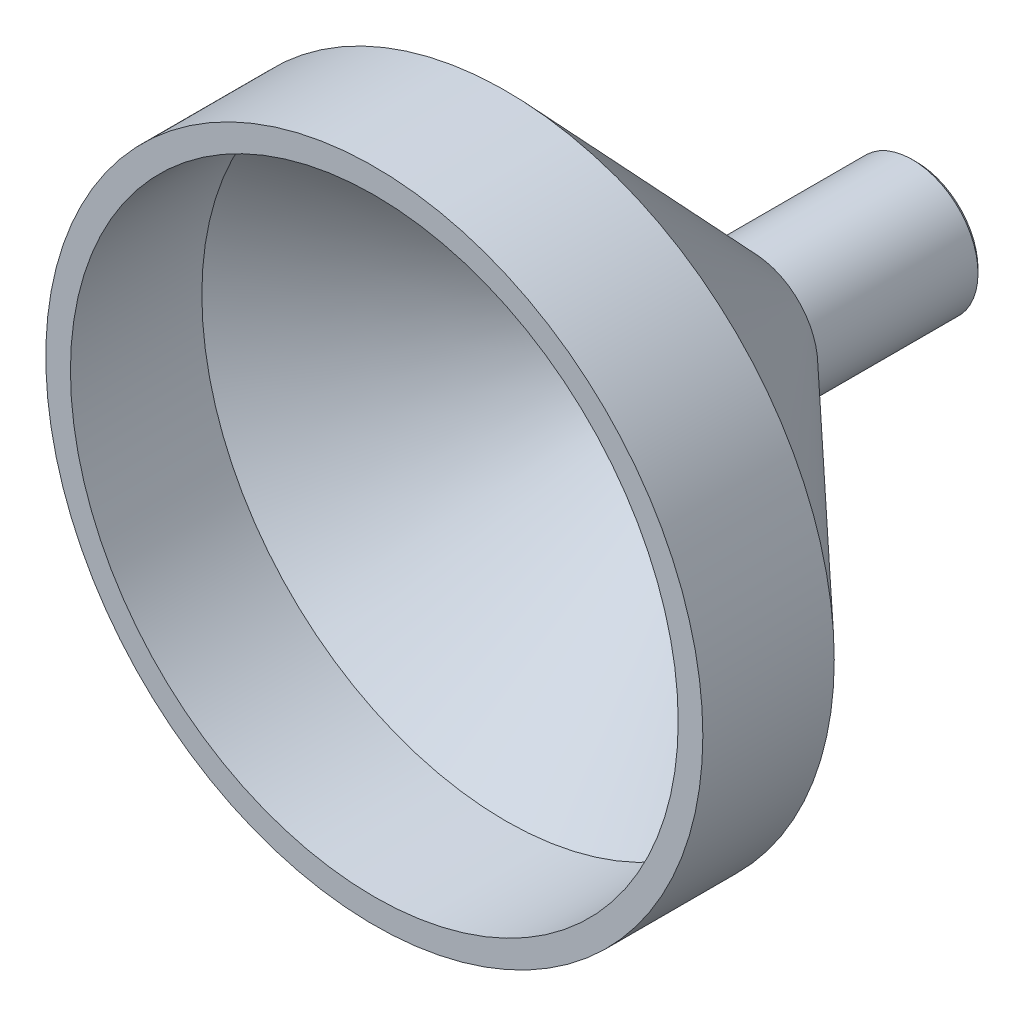
ISO-10303-21;
HEADER;
FILE_DESCRIPTION(('STEP AP214'),'2;1');
FILE_NAME('part.step','',(''),(''),'','','');
FILE_SCHEMA(('AUTOMOTIVE_DESIGN { 1 0 10303 214 1 1 1 1 }'));
ENDSEC;
DATA;
#1=APPLICATION_CONTEXT('core data for automotive mechanical design processes');
#2=APPLICATION_PROTOCOL_DEFINITION('international standard','automotive_design',2000,#1);
#3=PRODUCT_CONTEXT('',#1,'mechanical');
#4=PRODUCT('Part','Part','',(#3));
#5=PRODUCT_RELATED_PRODUCT_CATEGORY('part','',(#4));
#6=PRODUCT_DEFINITION_FORMATION('','',#4);
#7=PRODUCT_DEFINITION_CONTEXT('part definition',#1,'design');
#8=PRODUCT_DEFINITION('design','',#6,#7);
#9=PRODUCT_DEFINITION_SHAPE('','',#8);
#10=(LENGTH_UNIT() NAMED_UNIT(*) SI_UNIT(.MILLI.,.METRE.));
#11=(NAMED_UNIT(*) PLANE_ANGLE_UNIT() SI_UNIT($,.RADIAN.));
#12=(NAMED_UNIT(*) SI_UNIT($,.STERADIAN.) SOLID_ANGLE_UNIT());
#13=UNCERTAINTY_MEASURE_WITH_UNIT(LENGTH_MEASURE(1.E-05),#10,'distance_accuracy_value','');
#14=(GEOMETRIC_REPRESENTATION_CONTEXT(3) GLOBAL_UNCERTAINTY_ASSIGNED_CONTEXT((#13)) GLOBAL_UNIT_ASSIGNED_CONTEXT((#10,
#11,#12)) REPRESENTATION_CONTEXT('',''));
#15=CARTESIAN_POINT('',(0.,0.,0.));
#16=DIRECTION('',(0.,0.,1.));
#17=DIRECTION('',(1.,0.,0.));
#18=AXIS2_PLACEMENT_3D('',#15,#16,#17);
#19=CARTESIAN_POINT('',(-4.,0.,-25.));
#20=DIRECTION('',(0.,0.,1.));
#21=DIRECTION('',(1.,0.,0.));
#22=AXIS2_PLACEMENT_3D('',#19,#20,#21);
#23=PLANE('',#22);
#24=CARTESIAN_POINT('',(0.,0.,-25.));
#25=DIRECTION('',(0.,0.,1.));
#26=DIRECTION('',(1.,0.,0.));
#27=AXIS2_PLACEMENT_3D('',#24,#25,#26);
#28=CIRCLE('',#27,3.74999999999999);
#29=CARTESIAN_POINT('',(3.74999999999999,0.,-25.));
#30=VERTEX_POINT('',#29);
#31=EDGE_CURVE('E10',#30,#30,#28,.F.);
#32=ORIENTED_EDGE('',*,*,#31,.T.);
#33=EDGE_LOOP('',(#32));
#34=FACE_BOUND('',#33,.T.);
#35=CARTESIAN_POINT('',(0.,0.,-25.));
#36=DIRECTION('',(0.,0.,1.));
#37=DIRECTION('',(1.,0.,0.));
#38=AXIS2_PLACEMENT_3D('',#35,#36,#37);
#39=CIRCLE('',#38,3.25);
#40=CARTESIAN_POINT('',(3.25,0.,-25.));
#41=VERTEX_POINT('',#40);
#42=EDGE_CURVE('E63',#41,#41,#39,.T.);
#43=ORIENTED_EDGE('',*,*,#42,.T.);
#44=EDGE_LOOP('',(#43));
#45=FACE_BOUND('',#44,.T.);
#46=ADVANCED_FACE('F31',(#34,#45),#23,.F.);
#47=CARTESIAN_POINT('',(0.,0.,0.));
#48=DIRECTION('',(0.,0.,1.));
#49=DIRECTION('',(1.,0.,0.));
#50=AXIS2_PLACEMENT_3D('',#47,#48,#49);
#51=CYLINDRICAL_SURFACE('',#50,4.);
#52=CARTESIAN_POINT('',(0.,0.,-24.75));
#53=DIRECTION('',(0.,0.,1.));
#54=DIRECTION('',(1.,0.,0.));
#55=AXIS2_PLACEMENT_3D('',#52,#53,#54);
#56=CIRCLE('',#55,4.);
#57=CARTESIAN_POINT('',(4.,0.,-24.75));
#58=VERTEX_POINT('',#57);
#59=EDGE_CURVE('E38',#58,#58,#56,.T.);
#60=ORIENTED_EDGE('',*,*,#59,.T.);
#61=EDGE_LOOP('',(#60));
#62=FACE_BOUND('',#61,.T.);
#63=CARTESIAN_POINT('',(0.,0.,-15.));
#64=DIRECTION('',(0.,0.,1.));
#65=DIRECTION('',(1.,0.,0.));
#66=AXIS2_PLACEMENT_3D('',#63,#64,#65);
#67=CIRCLE('',#66,4.);
#68=CARTESIAN_POINT('',(4.,0.,-15.));
#69=VERTEX_POINT('',#68);
#70=EDGE_CURVE('E42',#69,#69,#67,.T.);
#71=ORIENTED_EDGE('',*,*,#70,.F.);
#72=EDGE_LOOP('',(#71));
#73=FACE_BOUND('',#72,.T.);
#74=ADVANCED_FACE('F101',(#62,#73),#51,.T.);
#75=CARTESIAN_POINT('',(0.,0.,-15.));
#76=DIRECTION('',(0.,0.,1.));
#77=DIRECTION('',(1.,0.,0.));
#78=AXIS2_PLACEMENT_3D('',#75,#76,#77);
#79=CONICAL_SURFACE('',#78,4.,0.817645045832702);
#80=CARTESIAN_POINT('',(0.,0.,0.));
#81=DIRECTION('',(0.,0.,1.));
#82=DIRECTION('',(1.,0.,0.));
#83=AXIS2_PLACEMENT_3D('',#80,#81,#82);
#84=CIRCLE('',#83,20.);
#85=CARTESIAN_POINT('',(20.,0.,0.));
#86=VERTEX_POINT('',#85);
#87=EDGE_CURVE('E46',#86,#86,#84,.T.);
#88=ORIENTED_EDGE('',*,*,#87,.F.);
#89=EDGE_LOOP('',(#88));
#90=FACE_BOUND('',#89,.T.);
#91=ORIENTED_EDGE('',*,*,#70,.T.);
#92=EDGE_LOOP('',(#91));
#93=FACE_BOUND('',#92,.T.);
#94=ADVANCED_FACE('F95',(#90,#93),#79,.T.);
#95=CARTESIAN_POINT('',(0.,0.,0.));
#96=DIRECTION('',(0.,0.,1.));
#97=DIRECTION('',(1.,0.,0.));
#98=AXIS2_PLACEMENT_3D('',#95,#96,#97);
#99=CYLINDRICAL_SURFACE('',#98,20.);
#100=CARTESIAN_POINT('',(0.,0.,8.));
#101=DIRECTION('',(0.,0.,1.));
#102=DIRECTION('',(1.,0.,0.));
#103=AXIS2_PLACEMENT_3D('',#100,#101,#102);
#104=CIRCLE('',#103,20.);
#105=CARTESIAN_POINT('',(20.,0.,8.));
#106=VERTEX_POINT('',#105);
#107=EDGE_CURVE('E51',#106,#106,#104,.T.);
#108=ORIENTED_EDGE('',*,*,#107,.F.);
#109=EDGE_LOOP('',(#108));
#110=FACE_BOUND('',#109,.T.);
#111=ORIENTED_EDGE('',*,*,#87,.T.);
#112=EDGE_LOOP('',(#111));
#113=FACE_BOUND('',#112,.T.);
#114=ADVANCED_FACE('F89',(#110,#113),#99,.T.);
#115=CARTESIAN_POINT('',(-18.5,0.,8.));
#116=DIRECTION('',(0.,0.,-1.));
#117=DIRECTION('',(-1.,0.,0.));
#118=AXIS2_PLACEMENT_3D('',#115,#116,#117);
#119=PLANE('',#118);
#120=CARTESIAN_POINT('',(0.,0.,8.));
#121=DIRECTION('',(0.,0.,1.));
#122=DIRECTION('',(1.,0.,0.));
#123=AXIS2_PLACEMENT_3D('',#120,#121,#122);
#124=CIRCLE('',#123,18.5);
#125=CARTESIAN_POINT('',(18.5,0.,8.));
#126=VERTEX_POINT('',#125);
#127=EDGE_CURVE('E54',#126,#126,#124,.T.);
#128=ORIENTED_EDGE('',*,*,#127,.F.);
#129=EDGE_LOOP('',(#128));
#130=FACE_BOUND('',#129,.T.);
#131=ORIENTED_EDGE('',*,*,#107,.T.);
#132=EDGE_LOOP('',(#131));
#133=FACE_BOUND('',#132,.T.);
#134=ADVANCED_FACE('F83',(#130,#133),#119,.F.);
#135=CARTESIAN_POINT('',(0.,0.,0.));
#136=DIRECTION('',(0.,0.,1.));
#137=DIRECTION('',(1.,0.,0.));
#138=AXIS2_PLACEMENT_3D('',#135,#136,#137);
#139=CYLINDRICAL_SURFACE('',#138,18.5);
#140=CARTESIAN_POINT('',(0.,0.,0.));
#141=DIRECTION('',(0.,0.,1.));
#142=DIRECTION('',(1.,0.,0.));
#143=AXIS2_PLACEMENT_3D('',#140,#141,#142);
#144=CIRCLE('',#143,18.5);
#145=CARTESIAN_POINT('',(18.5,0.,0.));
#146=VERTEX_POINT('',#145);
#147=EDGE_CURVE('E57',#146,#146,#144,.T.);
#148=ORIENTED_EDGE('',*,*,#147,.F.);
#149=EDGE_LOOP('',(#148));
#150=FACE_BOUND('',#149,.T.);
#151=ORIENTED_EDGE('',*,*,#127,.T.);
#152=EDGE_LOOP('',(#151));
#153=FACE_BOUND('',#152,.T.);
#154=ADVANCED_FACE('F77',(#150,#153),#139,.F.);
#155=CARTESIAN_POINT('',(0.,0.,0.));
#156=DIRECTION('',(0.,0.,1.));
#157=DIRECTION('',(1.,0.,0.));
#158=AXIS2_PLACEMENT_3D('',#155,#156,#157);
#159=CONICAL_SURFACE('',#158,18.5,0.817645045832702);
#160=CARTESIAN_POINT('',(0.,0.,-14.296875));
#161=DIRECTION('',(0.,0.,1.));
#162=DIRECTION('',(1.,0.,0.));
#163=AXIS2_PLACEMENT_3D('',#160,#161,#162);
#164=CIRCLE('',#163,3.25);
#165=CARTESIAN_POINT('',(3.25,0.,-14.296875));
#166=VERTEX_POINT('',#165);
#167=EDGE_CURVE('E60',#166,#166,#164,.T.);
#168=ORIENTED_EDGE('',*,*,#167,.F.);
#169=EDGE_LOOP('',(#168));
#170=FACE_BOUND('',#169,.T.);
#171=ORIENTED_EDGE('',*,*,#147,.T.);
#172=EDGE_LOOP('',(#171));
#173=FACE_BOUND('',#172,.T.);
#174=ADVANCED_FACE('F71',(#170,#173),#159,.F.);
#175=CARTESIAN_POINT('',(0.,0.,0.));
#176=DIRECTION('',(0.,0.,1.));
#177=DIRECTION('',(1.,0.,0.));
#178=AXIS2_PLACEMENT_3D('',#175,#176,#177);
#179=CYLINDRICAL_SURFACE('',#178,3.25);
#180=ORIENTED_EDGE('',*,*,#42,.F.);
#181=EDGE_LOOP('',(#180));
#182=FACE_BOUND('',#181,.T.);
#183=ORIENTED_EDGE('',*,*,#167,.T.);
#184=EDGE_LOOP('',(#183));
#185=FACE_BOUND('',#184,.T.);
#186=ADVANCED_FACE('F68',(#182,#185),#179,.F.);
#187=CARTESIAN_POINT('',(0.,0.,-24.75));
#188=DIRECTION('',(0.,0.,1.));
#189=DIRECTION('',(1.,0.,0.));
#190=AXIS2_PLACEMENT_3D('',#187,#188,#189);
#191=CONICAL_SURFACE('',#190,4.,0.785398163397448);
#192=ORIENTED_EDGE('',*,*,#31,.F.);
#193=EDGE_LOOP('',(#192));
#194=FACE_BOUND('',#193,.T.);
#195=ORIENTED_EDGE('',*,*,#59,.F.);
#196=EDGE_LOOP('',(#195));
#197=FACE_BOUND('',#196,.T.);
#198=ADVANCED_FACE('F33',(#194,#197),#191,.T.);
#199=CLOSED_SHELL('',(#46,#74,#94,#114,#134,#154,#174,#186,#198));
#200=MANIFOLD_SOLID_BREP('B2',#199);
#201=ADVANCED_BREP_SHAPE_REPRESENTATION('',(#18,#200),#14);
#202=SHAPE_DEFINITION_REPRESENTATION(#9,#201);
ENDSEC;
END-ISO-10303-21;
